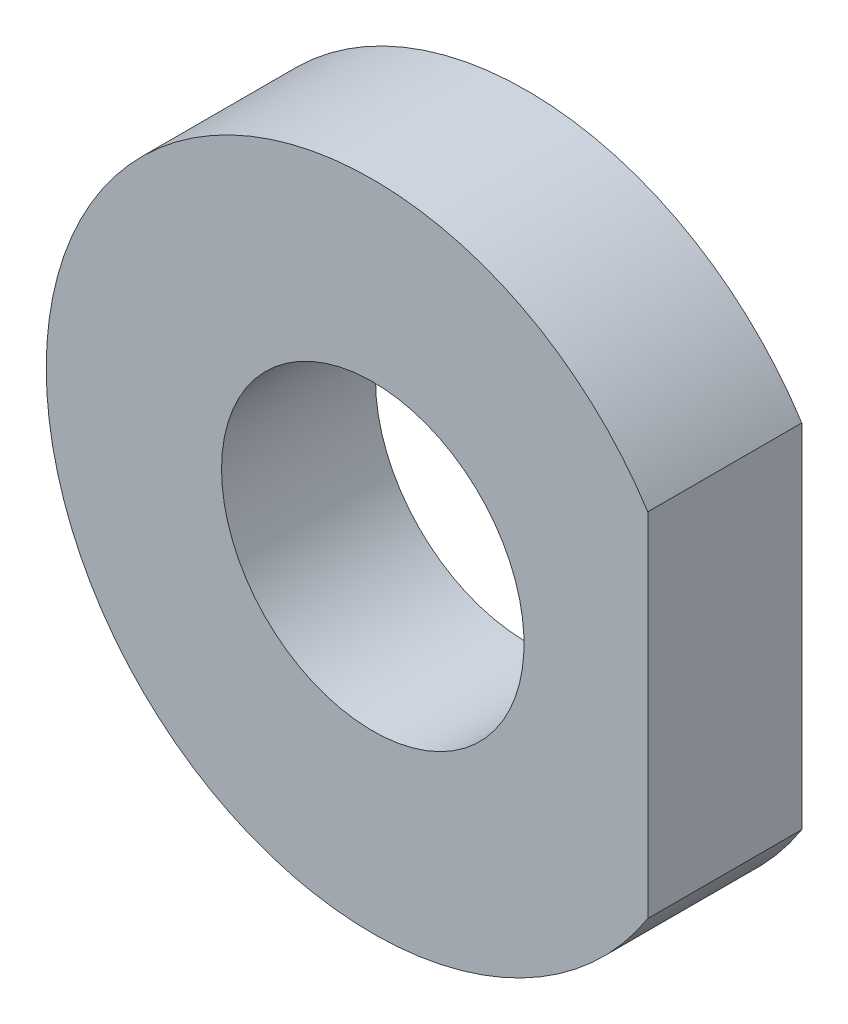
ISO-10303-21;
HEADER;
FILE_DESCRIPTION(('STEP AP214'),'2;1');
FILE_NAME('part.step','',(''),(''),'','','');
FILE_SCHEMA(('AUTOMOTIVE_DESIGN { 1 0 10303 214 1 1 1 1 }'));
ENDSEC;
DATA;
#1=APPLICATION_CONTEXT('core data for automotive mechanical design processes');
#2=APPLICATION_PROTOCOL_DEFINITION('international standard','automotive_design',2000,#1);
#3=PRODUCT_CONTEXT('',#1,'mechanical');
#4=PRODUCT('Part','Part','',(#3));
#5=PRODUCT_RELATED_PRODUCT_CATEGORY('part','',(#4));
#6=PRODUCT_DEFINITION_FORMATION('','',#4);
#7=PRODUCT_DEFINITION_CONTEXT('part definition',#1,'design');
#8=PRODUCT_DEFINITION('design','',#6,#7);
#9=PRODUCT_DEFINITION_SHAPE('','',#8);
#10=(LENGTH_UNIT() NAMED_UNIT(*) SI_UNIT(.MILLI.,.METRE.));
#11=(NAMED_UNIT(*) PLANE_ANGLE_UNIT() SI_UNIT($,.RADIAN.));
#12=(NAMED_UNIT(*) SI_UNIT($,.STERADIAN.) SOLID_ANGLE_UNIT());
#13=UNCERTAINTY_MEASURE_WITH_UNIT(LENGTH_MEASURE(1.E-05),#10,'distance_accuracy_value','');
#14=(GEOMETRIC_REPRESENTATION_CONTEXT(3) GLOBAL_UNCERTAINTY_ASSIGNED_CONTEXT((#13)) GLOBAL_UNIT_ASSIGNED_CONTEXT((#10,
#11,#12)) REPRESENTATION_CONTEXT('',''));
#15=CARTESIAN_POINT('',(0.,0.,0.));
#16=DIRECTION('',(0.,0.,1.));
#17=DIRECTION('',(1.,0.,0.));
#18=AXIS2_PLACEMENT_3D('',#15,#16,#17);
#19=CARTESIAN_POINT('',(10.5,0.,-1.));
#20=DIRECTION('',(0.,0.,-1.));
#21=DIRECTION('',(-1.,0.,0.));
#22=AXIS2_PLACEMENT_3D('',#19,#20,#21);
#23=CYLINDRICAL_SURFACE('',#22,2.375);
#24=CARTESIAN_POINT('',(10.5,0.,-1.));
#25=DIRECTION('',(0.,0.,1.));
#26=DIRECTION('',(0.842105263157895,0.5393131982084,0.));
#27=AXIS2_PLACEMENT_3D('',#24,#25,#26);
#28=CIRCLE('',#27,2.375);
#29=CARTESIAN_POINT('',(12.5,1.28086884574495,-1.));
#30=VERTEX_POINT('',#29);
#31=CARTESIAN_POINT('',(12.5,-1.28086884574495,-1.));
#32=VERTEX_POINT('',#31);
#33=EDGE_CURVE('E11',#30,#32,#28,.T.);
#34=ORIENTED_EDGE('',*,*,#33,.F.);
#35=DIRECTION('',(0.,0.,-1.));
#36=VECTOR('',#35,1.);
#37=CARTESIAN_POINT('',(12.5,1.28086884574495,-1.));
#38=LINE('',#37,#36);
#39=CARTESIAN_POINT('',(12.5,1.28086884574495,-2.12));
#40=VERTEX_POINT('',#39);
#41=EDGE_CURVE('E20',#30,#40,#38,.T.);
#42=ORIENTED_EDGE('',*,*,#41,.T.);
#43=CARTESIAN_POINT('',(10.5,0.,-2.12));
#44=DIRECTION('',(0.,0.,-1.));
#45=DIRECTION('',(0.842105263157895,0.5393131982084,0.));
#46=AXIS2_PLACEMENT_3D('',#43,#44,#45);
#47=CIRCLE('',#46,2.375);
#48=CARTESIAN_POINT('',(12.5,-1.28086884574495,-2.12));
#49=VERTEX_POINT('',#48);
#50=EDGE_CURVE('E27',#49,#40,#47,.T.);
#51=ORIENTED_EDGE('',*,*,#50,.F.);
#52=DIRECTION('',(0.,0.,-1.));
#53=VECTOR('',#52,1.);
#54=CARTESIAN_POINT('',(12.5,-1.28086884574495,-1.));
#55=LINE('',#54,#53);
#56=EDGE_CURVE('E70',#32,#49,#55,.T.);
#57=ORIENTED_EDGE('',*,*,#56,.F.);
#58=EDGE_LOOP('',(#34,#42,#51,#57));
#59=FACE_BOUND('',#58,.T.);
#60=ADVANCED_FACE('F16',(#59),#23,.T.);
#61=CARTESIAN_POINT('',(10.3125,0.,-1.));
#62=DIRECTION('',(0.,0.,1.));
#63=DIRECTION('',(1.,0.,0.));
#64=AXIS2_PLACEMENT_3D('',#61,#62,#63);
#65=PLANE('',#64);
#66=CARTESIAN_POINT('',(10.5,0.,-1.));
#67=DIRECTION('',(0.,0.,-1.));
#68=DIRECTION('',(1.,0.,0.));
#69=AXIS2_PLACEMENT_3D('',#66,#67,#68);
#70=CIRCLE('',#69,1.1);
#71=CARTESIAN_POINT('',(9.4,0.,-1.));
#72=VERTEX_POINT('',#71);
#73=EDGE_CURVE('E54',#72,#72,#70,.T.);
#74=ORIENTED_EDGE('',*,*,#73,.T.);
#75=EDGE_LOOP('',(#74));
#76=FACE_BOUND('',#75,.T.);
#77=ORIENTED_EDGE('',*,*,#33,.T.);
#78=DIRECTION('',(0.,-1.,0.));
#79=VECTOR('',#78,1.);
#80=CARTESIAN_POINT('',(12.5,15.780868845745,-1.));
#81=LINE('',#80,#79);
#82=EDGE_CURVE('E68',#30,#32,#81,.T.);
#83=ORIENTED_EDGE('',*,*,#82,.F.);
#84=EDGE_LOOP('',(#77,#83));
#85=FACE_BOUND('',#84,.T.);
#86=ADVANCED_FACE('F66',(#76,#85),#65,.T.);
#87=CARTESIAN_POINT('',(10.3125,0.,-2.12));
#88=DIRECTION('',(0.,0.,1.));
#89=DIRECTION('',(1.,0.,0.));
#90=AXIS2_PLACEMENT_3D('',#87,#88,#89);
#91=PLANE('',#90);
#92=CARTESIAN_POINT('',(10.5,0.,-2.12));
#93=DIRECTION('',(0.,0.,1.));
#94=DIRECTION('',(1.,0.,0.));
#95=AXIS2_PLACEMENT_3D('',#92,#93,#94);
#96=CIRCLE('',#95,1.1);
#97=CARTESIAN_POINT('',(9.4,0.,-2.12));
#98=VERTEX_POINT('',#97);
#99=EDGE_CURVE('E89',#98,#98,#96,.T.);
#100=ORIENTED_EDGE('',*,*,#99,.T.);
#101=EDGE_LOOP('',(#100));
#102=FACE_BOUND('',#101,.T.);
#103=ORIENTED_EDGE('',*,*,#50,.T.);
#104=DIRECTION('',(0.,-1.,0.));
#105=VECTOR('',#104,1.);
#106=CARTESIAN_POINT('',(12.5,15.780868845745,-2.12));
#107=LINE('',#106,#105);
#108=EDGE_CURVE('E74',#40,#49,#107,.T.);
#109=ORIENTED_EDGE('',*,*,#108,.T.);
#110=EDGE_LOOP('',(#103,#109));
#111=FACE_BOUND('',#110,.T.);
#112=ADVANCED_FACE('F18',(#102,#111),#91,.F.);
#113=CARTESIAN_POINT('',(12.5,1.28086884574495,-1.));
#114=DIRECTION('',(1.,0.,0.));
#115=DIRECTION('',(0.,1.,0.));
#116=AXIS2_PLACEMENT_3D('',#113,#114,#115);
#117=PLANE('',#116);
#118=ORIENTED_EDGE('',*,*,#82,.T.);
#119=ORIENTED_EDGE('',*,*,#56,.T.);
#120=ORIENTED_EDGE('',*,*,#108,.F.);
#121=ORIENTED_EDGE('',*,*,#41,.F.);
#122=EDGE_LOOP('',(#118,#119,#120,#121));
#123=FACE_BOUND('',#122,.T.);
#124=ADVANCED_FACE('F76',(#123),#117,.T.);
#125=CARTESIAN_POINT('',(10.5,0.,-1.));
#126=DIRECTION('',(0.,0.,-1.));
#127=DIRECTION('',(1.,0.,0.));
#128=AXIS2_PLACEMENT_3D('',#125,#126,#127);
#129=CYLINDRICAL_SURFACE('',#128,1.1);
#130=ORIENTED_EDGE('',*,*,#99,.F.);
#131=DIRECTION('',(0.,0.,1.));
#132=VECTOR('',#131,1.);
#133=CARTESIAN_POINT('',(9.4,0.,-1.));
#134=LINE('',#133,#132);
#135=EDGE_CURVE('E84',#98,#72,#134,.T.);
#136=ORIENTED_EDGE('',*,*,#135,.T.);
#137=ORIENTED_EDGE('',*,*,#73,.F.);
#138=ORIENTED_EDGE('',*,*,#135,.F.);
#139=EDGE_LOOP('',(#130,#136,#137,#138));
#140=FACE_BOUND('',#139,.T.);
#141=ADVANCED_FACE('F101',(#140),#129,.F.);
#142=CLOSED_SHELL('',(#60,#86,#112,#124,#141));
#143=MANIFOLD_SOLID_BREP('B1',#142);
#144=ADVANCED_BREP_SHAPE_REPRESENTATION('',(#18,#143),#14);
#145=SHAPE_DEFINITION_REPRESENTATION(#9,#144);
ENDSEC;
END-ISO-10303-21;
